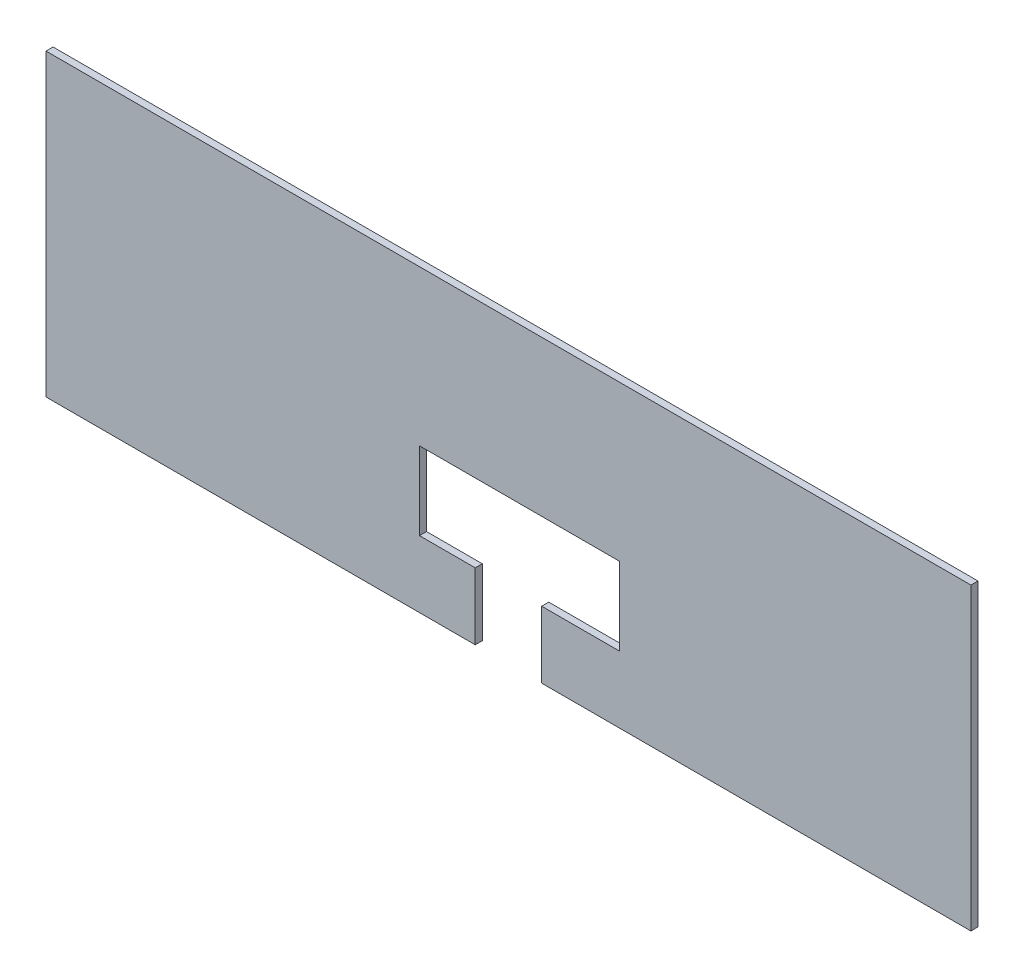
ISO-10303-21;
HEADER;
FILE_DESCRIPTION(('STEP AP214'),'2;1');
FILE_NAME('part.step','',(''),(''),'','','');
FILE_SCHEMA(('AUTOMOTIVE_DESIGN { 1 0 10303 214 1 1 1 1 }'));
ENDSEC;
DATA;
#1=APPLICATION_CONTEXT('core data for automotive mechanical design processes');
#2=APPLICATION_PROTOCOL_DEFINITION('international standard','automotive_design',2000,#1);
#3=PRODUCT_CONTEXT('',#1,'mechanical');
#4=PRODUCT('Part','Part','',(#3));
#5=PRODUCT_RELATED_PRODUCT_CATEGORY('part','',(#4));
#6=PRODUCT_DEFINITION_FORMATION('','',#4);
#7=PRODUCT_DEFINITION_CONTEXT('part definition',#1,'design');
#8=PRODUCT_DEFINITION('design','',#6,#7);
#9=PRODUCT_DEFINITION_SHAPE('','',#8);
#10=(LENGTH_UNIT() NAMED_UNIT(*) SI_UNIT(.MILLI.,.METRE.));
#11=(NAMED_UNIT(*) PLANE_ANGLE_UNIT() SI_UNIT($,.RADIAN.));
#12=(NAMED_UNIT(*) SI_UNIT($,.STERADIAN.) SOLID_ANGLE_UNIT());
#13=UNCERTAINTY_MEASURE_WITH_UNIT(LENGTH_MEASURE(1.E-05),#10,'distance_accuracy_value','');
#14=(GEOMETRIC_REPRESENTATION_CONTEXT(3) GLOBAL_UNCERTAINTY_ASSIGNED_CONTEXT((#13)) GLOBAL_UNIT_ASSIGNED_CONTEXT((#10,
#11,#12)) REPRESENTATION_CONTEXT('',''));
#15=CARTESIAN_POINT('',(0.,0.,0.));
#16=DIRECTION('',(0.,0.,1.));
#17=DIRECTION('',(1.,0.,0.));
#18=AXIS2_PLACEMENT_3D('',#15,#16,#17);
#19=CARTESIAN_POINT('',(-368.44287750437,111.148523923538,3.175));
#20=DIRECTION('',(1.,0.,0.));
#21=DIRECTION('',(0.,0.,-1.));
#22=AXIS2_PLACEMENT_3D('',#19,#20,#21);
#23=PLANE('',#22);
#24=DIRECTION('',(0.,-1.,0.));
#25=VECTOR('',#24,1.);
#26=CARTESIAN_POINT('',(-368.44287750437,111.148523923538,0.));
#27=LINE('',#26,#25);
#28=CARTESIAN_POINT('',(-368.44287750437,111.148523923538,0.));
#29=VERTEX_POINT('',#28);
#30=CARTESIAN_POINT('',(-368.44287750437,-23.6264760764616,0.));
#31=VERTEX_POINT('',#30);
#32=EDGE_CURVE('E159',#29,#31,#27,.T.);
#33=ORIENTED_EDGE('',*,*,#32,.T.);
#34=DIRECTION('',(0.,0.,-1.));
#35=VECTOR('',#34,1.);
#36=CARTESIAN_POINT('',(-368.44287750437,-23.6264760764616,3.175));
#37=LINE('',#36,#35);
#38=CARTESIAN_POINT('',(-368.44287750437,-23.6264760764616,3.175));
#39=VERTEX_POINT('',#38);
#40=EDGE_CURVE('E11',#39,#31,#37,.T.);
#41=ORIENTED_EDGE('',*,*,#40,.F.);
#42=DIRECTION('',(0.,-1.,0.));
#43=VECTOR('',#42,1.);
#44=CARTESIAN_POINT('',(-368.44287750437,111.148523923538,3.175));
#45=LINE('',#44,#43);
#46=CARTESIAN_POINT('',(-368.44287750437,111.148523923538,3.175));
#47=VERTEX_POINT('',#46);
#48=EDGE_CURVE('E181',#47,#39,#45,.T.);
#49=ORIENTED_EDGE('',*,*,#48,.F.);
#50=DIRECTION('',(0.,0.,-1.));
#51=VECTOR('',#50,1.);
#52=CARTESIAN_POINT('',(-368.44287750437,111.148523923538,3.175));
#53=LINE('',#52,#51);
#54=EDGE_CURVE('E155',#47,#29,#53,.T.);
#55=ORIENTED_EDGE('',*,*,#54,.T.);
#56=EDGE_LOOP('',(#33,#41,#49,#55));
#57=FACE_BOUND('',#56,.T.);
#58=ADVANCED_FACE('F39',(#57),#23,.F.);
#59=CARTESIAN_POINT('',(-368.44287750437,-23.6264760764616,3.175));
#60=DIRECTION('',(0.,1.,0.));
#61=DIRECTION('',(0.,0.,1.));
#62=AXIS2_PLACEMENT_3D('',#59,#60,#61);
#63=PLANE('',#62);
#64=DIRECTION('',(1.,0.,0.));
#65=VECTOR('',#64,1.);
#66=CARTESIAN_POINT('',(-368.44287750437,-23.6264760764616,0.));
#67=LINE('',#66,#65);
#68=CARTESIAN_POINT('',(-175.35287750437,-23.6264760764616,0.));
#69=VERTEX_POINT('',#68);
#70=EDGE_CURVE('E162',#31,#69,#67,.T.);
#71=ORIENTED_EDGE('',*,*,#70,.T.);
#72=DIRECTION('',(0.,0.,-1.));
#73=VECTOR('',#72,1.);
#74=CARTESIAN_POINT('',(-175.35287750437,-23.6264760764616,3.175));
#75=LINE('',#74,#73);
#76=CARTESIAN_POINT('',(-175.35287750437,-23.6264760764616,3.175));
#77=VERTEX_POINT('',#76);
#78=EDGE_CURVE('E47',#77,#69,#75,.T.);
#79=ORIENTED_EDGE('',*,*,#78,.F.);
#80=DIRECTION('',(1.,0.,0.));
#81=VECTOR('',#80,1.);
#82=CARTESIAN_POINT('',(-368.44287750437,-23.6264760764616,3.175));
#83=LINE('',#82,#81);
#84=EDGE_CURVE('E110',#39,#77,#83,.T.);
#85=ORIENTED_EDGE('',*,*,#84,.F.);
#86=ORIENTED_EDGE('',*,*,#40,.T.);
#87=EDGE_LOOP('',(#71,#79,#85,#86));
#88=FACE_BOUND('',#87,.T.);
#89=ADVANCED_FACE('F259',(#88),#63,.F.);
#90=CARTESIAN_POINT('',(-175.35287750437,6.37352392353839,3.175));
#91=DIRECTION('',(-1.,0.,0.));
#92=DIRECTION('',(0.,0.,1.));
#93=AXIS2_PLACEMENT_3D('',#90,#91,#92);
#94=PLANE('',#93);
#95=DIRECTION('',(0.,1.,0.));
#96=VECTOR('',#95,1.);
#97=CARTESIAN_POINT('',(-175.35287750437,6.37352392353839,0.));
#98=LINE('',#97,#96);
#99=CARTESIAN_POINT('',(-175.35287750437,6.37352392353839,0.));
#100=VERTEX_POINT('',#99);
#101=EDGE_CURVE('E164',#69,#100,#98,.T.);
#102=ORIENTED_EDGE('',*,*,#101,.T.);
#103=DIRECTION('',(0.,0.,-1.));
#104=VECTOR('',#103,1.);
#105=CARTESIAN_POINT('',(-175.35287750437,6.37352392353839,3.175));
#106=LINE('',#105,#104);
#107=CARTESIAN_POINT('',(-175.35287750437,6.37352392353839,3.175));
#108=VERTEX_POINT('',#107);
#109=EDGE_CURVE('E200',#108,#100,#106,.T.);
#110=ORIENTED_EDGE('',*,*,#109,.F.);
#111=DIRECTION('',(0.,1.,0.));
#112=VECTOR('',#111,1.);
#113=CARTESIAN_POINT('',(-175.35287750437,6.37352392353839,3.175));
#114=LINE('',#113,#112);
#115=EDGE_CURVE('E208',#77,#108,#114,.T.);
#116=ORIENTED_EDGE('',*,*,#115,.F.);
#117=ORIENTED_EDGE('',*,*,#78,.T.);
#118=EDGE_LOOP('',(#102,#110,#116,#117));
#119=FACE_BOUND('',#118,.T.);
#120=ADVANCED_FACE('F206',(#119),#94,.F.);
#121=CARTESIAN_POINT('',(-175.35287750437,6.37352392353839,3.175));
#122=DIRECTION('',(0.,-1.,0.));
#123=DIRECTION('',(1.,0.,0.));
#124=AXIS2_PLACEMENT_3D('',#121,#122,#123);
#125=PLANE('',#124);
#126=DIRECTION('',(-1.,0.,0.));
#127=VECTOR('',#126,1.);
#128=CARTESIAN_POINT('',(-175.35287750437,6.37352392353839,0.));
#129=LINE('',#128,#127);
#130=CARTESIAN_POINT('',(-200.43364614192,6.37352392353836,0.));
#131=VERTEX_POINT('',#130);
#132=EDGE_CURVE('E166',#100,#131,#129,.T.);
#133=ORIENTED_EDGE('',*,*,#132,.T.);
#134=DIRECTION('',(0.,0.,-1.));
#135=VECTOR('',#134,1.);
#136=CARTESIAN_POINT('',(-200.43364614192,6.37352392353836,3.175));
#137=LINE('',#136,#135);
#138=CARTESIAN_POINT('',(-200.43364614192,6.37352392353836,3.175));
#139=VERTEX_POINT('',#138);
#140=EDGE_CURVE('E197',#139,#131,#137,.T.);
#141=ORIENTED_EDGE('',*,*,#140,.F.);
#142=DIRECTION('',(-1.,0.,0.));
#143=VECTOR('',#142,1.);
#144=CARTESIAN_POINT('',(-175.35287750437,6.37352392353839,3.175));
#145=LINE('',#144,#143);
#146=EDGE_CURVE('E226',#108,#139,#145,.T.);
#147=ORIENTED_EDGE('',*,*,#146,.F.);
#148=ORIENTED_EDGE('',*,*,#109,.T.);
#149=EDGE_LOOP('',(#133,#141,#147,#148));
#150=FACE_BOUND('',#149,.T.);
#151=ADVANCED_FACE('F217',(#150),#125,.F.);
#152=CARTESIAN_POINT('',(-200.43364614192,6.37352392353836,3.175));
#153=DIRECTION('',(-1.,0.,0.));
#154=DIRECTION('',(0.,0.,1.));
#155=AXIS2_PLACEMENT_3D('',#152,#153,#154);
#156=PLANE('',#155);
#157=DIRECTION('',(0.,1.,0.));
#158=VECTOR('',#157,1.);
#159=CARTESIAN_POINT('',(-200.43364614192,6.37352392353836,0.));
#160=LINE('',#159,#158);
#161=CARTESIAN_POINT('',(-200.43364614192,41.3735239235383,0.));
#162=VERTEX_POINT('',#161);
#163=EDGE_CURVE('E168',#131,#162,#160,.T.);
#164=ORIENTED_EDGE('',*,*,#163,.T.);
#165=DIRECTION('',(0.,0.,-1.));
#166=VECTOR('',#165,1.);
#167=CARTESIAN_POINT('',(-200.43364614192,41.3735239235383,3.175));
#168=LINE('',#167,#166);
#169=CARTESIAN_POINT('',(-200.43364614192,41.3735239235383,3.175));
#170=VERTEX_POINT('',#169);
#171=EDGE_CURVE('E194',#170,#162,#168,.T.);
#172=ORIENTED_EDGE('',*,*,#171,.F.);
#173=DIRECTION('',(0.,1.,0.));
#174=VECTOR('',#173,1.);
#175=CARTESIAN_POINT('',(-200.43364614192,6.37352392353836,3.175));
#176=LINE('',#175,#174);
#177=EDGE_CURVE('E223',#139,#170,#176,.T.);
#178=ORIENTED_EDGE('',*,*,#177,.F.);
#179=ORIENTED_EDGE('',*,*,#140,.T.);
#180=EDGE_LOOP('',(#164,#172,#178,#179));
#181=FACE_BOUND('',#180,.T.);
#182=ADVANCED_FACE('F221',(#181),#156,.F.);
#183=CARTESIAN_POINT('',(-110.45287750437,41.3735239235383,3.175));
#184=DIRECTION('',(0.,1.,0.));
#185=DIRECTION('',(0.,0.,1.));
#186=AXIS2_PLACEMENT_3D('',#183,#184,#185);
#187=PLANE('',#186);
#188=DIRECTION('',(1.,0.,0.));
#189=VECTOR('',#188,1.);
#190=CARTESIAN_POINT('',(-110.45287750437,41.3735239235383,0.));
#191=LINE('',#190,#189);
#192=CARTESIAN_POINT('',(-110.45287750437,41.3735239235383,0.));
#193=VERTEX_POINT('',#192);
#194=EDGE_CURVE('E170',#162,#193,#191,.T.);
#195=ORIENTED_EDGE('',*,*,#194,.T.);
#196=DIRECTION('',(0.,0.,-1.));
#197=VECTOR('',#196,1.);
#198=CARTESIAN_POINT('',(-110.45287750437,41.3735239235383,3.175));
#199=LINE('',#198,#197);
#200=CARTESIAN_POINT('',(-110.45287750437,41.3735239235383,3.175));
#201=VERTEX_POINT('',#200);
#202=EDGE_CURVE('E191',#201,#193,#199,.T.);
#203=ORIENTED_EDGE('',*,*,#202,.F.);
#204=DIRECTION('',(1.,0.,0.));
#205=VECTOR('',#204,1.);
#206=CARTESIAN_POINT('',(-110.45287750437,41.3735239235383,3.175));
#207=LINE('',#206,#205);
#208=EDGE_CURVE('E225',#170,#201,#207,.T.);
#209=ORIENTED_EDGE('',*,*,#208,.F.);
#210=ORIENTED_EDGE('',*,*,#171,.T.);
#211=EDGE_LOOP('',(#195,#203,#209,#210));
#212=FACE_BOUND('',#211,.T.);
#213=ADVANCED_FACE('F272',(#212),#187,.F.);
#214=CARTESIAN_POINT('',(-110.45287750437,6.3735239235383,3.175));
#215=DIRECTION('',(1.,0.,0.));
#216=DIRECTION('',(0.,0.,-1.));
#217=AXIS2_PLACEMENT_3D('',#214,#215,#216);
#218=PLANE('',#217);
#219=DIRECTION('',(0.,-1.,0.));
#220=VECTOR('',#219,1.);
#221=CARTESIAN_POINT('',(-110.45287750437,6.3735239235383,0.));
#222=LINE('',#221,#220);
#223=CARTESIAN_POINT('',(-110.45287750437,6.3735239235383,0.));
#224=VERTEX_POINT('',#223);
#225=EDGE_CURVE('E172',#193,#224,#222,.T.);
#226=ORIENTED_EDGE('',*,*,#225,.T.);
#227=DIRECTION('',(0.,0.,-1.));
#228=VECTOR('',#227,1.);
#229=CARTESIAN_POINT('',(-110.45287750437,6.3735239235383,3.175));
#230=LINE('',#229,#228);
#231=CARTESIAN_POINT('',(-110.45287750437,6.3735239235383,3.175));
#232=VERTEX_POINT('',#231);
#233=EDGE_CURVE('E188',#232,#224,#230,.T.);
#234=ORIENTED_EDGE('',*,*,#233,.F.);
#235=DIRECTION('',(0.,-1.,0.));
#236=VECTOR('',#235,1.);
#237=CARTESIAN_POINT('',(-110.45287750437,6.3735239235383,3.175));
#238=LINE('',#237,#236);
#239=EDGE_CURVE('E228',#201,#232,#238,.T.);
#240=ORIENTED_EDGE('',*,*,#239,.F.);
#241=ORIENTED_EDGE('',*,*,#202,.T.);
#242=EDGE_LOOP('',(#226,#234,#240,#241));
#243=FACE_BOUND('',#242,.T.);
#244=ADVANCED_FACE('F275',(#243),#218,.F.);
#245=CARTESIAN_POINT('',(-145.45287750437,6.3735239235383,3.175));
#246=DIRECTION('',(0.,-1.,0.));
#247=DIRECTION('',(0.,0.,-1.));
#248=AXIS2_PLACEMENT_3D('',#245,#246,#247);
#249=PLANE('',#248);
#250=DIRECTION('',(-1.,0.,0.));
#251=VECTOR('',#250,1.);
#252=CARTESIAN_POINT('',(-145.45287750437,6.3735239235383,0.));
#253=LINE('',#252,#251);
#254=CARTESIAN_POINT('',(-145.45287750437,6.3735239235383,0.));
#255=VERTEX_POINT('',#254);
#256=EDGE_CURVE('E174',#224,#255,#253,.T.);
#257=ORIENTED_EDGE('',*,*,#256,.T.);
#258=DIRECTION('',(0.,0.,-1.));
#259=VECTOR('',#258,1.);
#260=CARTESIAN_POINT('',(-145.45287750437,6.3735239235383,3.175));
#261=LINE('',#260,#259);
#262=CARTESIAN_POINT('',(-145.45287750437,6.3735239235383,3.175));
#263=VERTEX_POINT('',#262);
#264=EDGE_CURVE('E185',#263,#255,#261,.T.);
#265=ORIENTED_EDGE('',*,*,#264,.F.);
#266=DIRECTION('',(-1.,0.,0.));
#267=VECTOR('',#266,1.);
#268=CARTESIAN_POINT('',(-145.45287750437,6.3735239235383,3.175));
#269=LINE('',#268,#267);
#270=EDGE_CURVE('E234',#232,#263,#269,.T.);
#271=ORIENTED_EDGE('',*,*,#270,.F.);
#272=ORIENTED_EDGE('',*,*,#233,.T.);
#273=EDGE_LOOP('',(#257,#265,#271,#272));
#274=FACE_BOUND('',#273,.T.);
#275=ADVANCED_FACE('F240',(#274),#249,.F.);
#276=CARTESIAN_POINT('',(-145.45287750437,6.3735239235383,3.175));
#277=DIRECTION('',(1.,0.,0.));
#278=DIRECTION('',(0.,0.,-1.));
#279=AXIS2_PLACEMENT_3D('',#276,#277,#278);
#280=PLANE('',#279);
#281=DIRECTION('',(0.,-1.,0.));
#282=VECTOR('',#281,1.);
#283=CARTESIAN_POINT('',(-145.45287750437,6.3735239235383,0.));
#284=LINE('',#283,#282);
#285=CARTESIAN_POINT('',(-145.45287750437,-23.6264760764616,0.));
#286=VERTEX_POINT('',#285);
#287=EDGE_CURVE('E176',#255,#286,#284,.T.);
#288=ORIENTED_EDGE('',*,*,#287,.T.);
#289=DIRECTION('',(0.,0.,-1.));
#290=VECTOR('',#289,1.);
#291=CARTESIAN_POINT('',(-145.45287750437,-23.6264760764616,3.175));
#292=LINE('',#291,#290);
#293=CARTESIAN_POINT('',(-145.45287750437,-23.6264760764616,3.175));
#294=VERTEX_POINT('',#293);
#295=EDGE_CURVE('E150',#294,#286,#292,.T.);
#296=ORIENTED_EDGE('',*,*,#295,.F.);
#297=DIRECTION('',(0.,-1.,0.));
#298=VECTOR('',#297,1.);
#299=CARTESIAN_POINT('',(-145.45287750437,6.3735239235383,3.175));
#300=LINE('',#299,#298);
#301=EDGE_CURVE('E141',#263,#294,#300,.T.);
#302=ORIENTED_EDGE('',*,*,#301,.F.);
#303=ORIENTED_EDGE('',*,*,#264,.T.);
#304=EDGE_LOOP('',(#288,#296,#302,#303));
#305=FACE_BOUND('',#304,.T.);
#306=ADVANCED_FACE('F244',(#305),#280,.F.);
#307=CARTESIAN_POINT('',(-145.45287750437,-23.6264760764616,3.175));
#308=DIRECTION('',(0.,1.,0.));
#309=DIRECTION('',(0.,0.,1.));
#310=AXIS2_PLACEMENT_3D('',#307,#308,#309);
#311=PLANE('',#310);
#312=DIRECTION('',(1.,0.,0.));
#313=VECTOR('',#312,1.);
#314=CARTESIAN_POINT('',(-145.45287750437,-23.6264760764616,0.));
#315=LINE('',#314,#313);
#316=CARTESIAN_POINT('',(47.63712249563,-23.6264760764616,0.));
#317=VERTEX_POINT('',#316);
#318=EDGE_CURVE('E149',#286,#317,#315,.T.);
#319=ORIENTED_EDGE('',*,*,#318,.T.);
#320=DIRECTION('',(0.,0.,-1.));
#321=VECTOR('',#320,1.);
#322=CARTESIAN_POINT('',(47.63712249563,-23.6264760764616,3.175));
#323=LINE('',#322,#321);
#324=CARTESIAN_POINT('',(47.63712249563,-23.6264760764616,3.175));
#325=VERTEX_POINT('',#324);
#326=EDGE_CURVE('E146',#325,#317,#323,.T.);
#327=ORIENTED_EDGE('',*,*,#326,.F.);
#328=DIRECTION('',(1.,0.,0.));
#329=VECTOR('',#328,1.);
#330=CARTESIAN_POINT('',(-145.45287750437,-23.6264760764616,3.175));
#331=LINE('',#330,#329);
#332=EDGE_CURVE('E135',#294,#325,#331,.T.);
#333=ORIENTED_EDGE('',*,*,#332,.F.);
#334=ORIENTED_EDGE('',*,*,#295,.T.);
#335=EDGE_LOOP('',(#319,#327,#333,#334));
#336=FACE_BOUND('',#335,.T.);
#337=ADVANCED_FACE('F147',(#336),#311,.F.);
#338=CARTESIAN_POINT('',(47.63712249563,111.148523923538,3.175));
#339=DIRECTION('',(-1.,0.,0.));
#340=DIRECTION('',(0.,0.,1.));
#341=AXIS2_PLACEMENT_3D('',#338,#339,#340);
#342=PLANE('',#341);
#343=DIRECTION('',(0.,1.,0.));
#344=VECTOR('',#343,1.);
#345=CARTESIAN_POINT('',(47.63712249563,111.148523923538,0.));
#346=LINE('',#345,#344);
#347=CARTESIAN_POINT('',(47.63712249563,111.148523923538,0.));
#348=VERTEX_POINT('',#347);
#349=EDGE_CURVE('E96',#317,#348,#346,.T.);
#350=ORIENTED_EDGE('',*,*,#349,.T.);
#351=DIRECTION('',(0.,0.,-1.));
#352=VECTOR('',#351,1.);
#353=CARTESIAN_POINT('',(47.63712249563,111.148523923538,3.175));
#354=LINE('',#353,#352);
#355=CARTESIAN_POINT('',(47.63712249563,111.148523923538,3.175));
#356=VERTEX_POINT('',#355);
#357=EDGE_CURVE('E151',#356,#348,#354,.T.);
#358=ORIENTED_EDGE('',*,*,#357,.F.);
#359=DIRECTION('',(0.,1.,0.));
#360=VECTOR('',#359,1.);
#361=CARTESIAN_POINT('',(47.63712249563,111.148523923538,3.175));
#362=LINE('',#361,#360);
#363=EDGE_CURVE('E139',#325,#356,#362,.T.);
#364=ORIENTED_EDGE('',*,*,#363,.F.);
#365=ORIENTED_EDGE('',*,*,#326,.T.);
#366=EDGE_LOOP('',(#350,#358,#364,#365));
#367=FACE_BOUND('',#366,.T.);
#368=ADVANCED_FACE('F153',(#367),#342,.F.);
#369=CARTESIAN_POINT('',(-368.44287750437,111.148523923538,3.175));
#370=DIRECTION('',(0.,-1.,0.));
#371=DIRECTION('',(1.,0.,0.));
#372=AXIS2_PLACEMENT_3D('',#369,#370,#371);
#373=PLANE('',#372);
#374=DIRECTION('',(-1.,0.,0.));
#375=VECTOR('',#374,1.);
#376=CARTESIAN_POINT('',(-368.44287750437,111.148523923538,0.));
#377=LINE('',#376,#375);
#378=EDGE_CURVE('E102',#348,#29,#377,.T.);
#379=ORIENTED_EDGE('',*,*,#378,.T.);
#380=ORIENTED_EDGE('',*,*,#54,.F.);
#381=DIRECTION('',(-1.,0.,0.));
#382=VECTOR('',#381,1.);
#383=CARTESIAN_POINT('',(-368.44287750437,111.148523923538,3.175));
#384=LINE('',#383,#382);
#385=EDGE_CURVE('E55',#356,#47,#384,.T.);
#386=ORIENTED_EDGE('',*,*,#385,.F.);
#387=ORIENTED_EDGE('',*,*,#357,.T.);
#388=EDGE_LOOP('',(#379,#380,#386,#387));
#389=FACE_BOUND('',#388,.T.);
#390=ADVANCED_FACE('F248',(#389),#373,.F.);
#391=CARTESIAN_POINT('',(0.,0.,3.175));
#392=DIRECTION('',(0.,0.,1.));
#393=DIRECTION('',(1.,0.,0.));
#394=AXIS2_PLACEMENT_3D('',#391,#392,#393);
#395=PLANE('',#394);
#396=ORIENTED_EDGE('',*,*,#48,.T.);
#397=ORIENTED_EDGE('',*,*,#84,.T.);
#398=ORIENTED_EDGE('',*,*,#115,.T.);
#399=ORIENTED_EDGE('',*,*,#146,.T.);
#400=ORIENTED_EDGE('',*,*,#177,.T.);
#401=ORIENTED_EDGE('',*,*,#208,.T.);
#402=ORIENTED_EDGE('',*,*,#239,.T.);
#403=ORIENTED_EDGE('',*,*,#270,.T.);
#404=ORIENTED_EDGE('',*,*,#301,.T.);
#405=ORIENTED_EDGE('',*,*,#332,.T.);
#406=ORIENTED_EDGE('',*,*,#363,.T.);
#407=ORIENTED_EDGE('',*,*,#385,.T.);
#408=EDGE_LOOP('',(#396,#397,#398,#399,#400,#401,#402,#403,#404,#405,#406,#407));
#409=FACE_BOUND('',#408,.T.);
#410=ADVANCED_FACE('F137',(#409),#395,.T.);
#411=CARTESIAN_POINT('',(0.,0.,0.));
#412=DIRECTION('',(0.,0.,1.));
#413=DIRECTION('',(1.,0.,0.));
#414=AXIS2_PLACEMENT_3D('',#411,#412,#413);
#415=PLANE('',#414);
#416=ORIENTED_EDGE('',*,*,#32,.F.);
#417=ORIENTED_EDGE('',*,*,#378,.F.);
#418=ORIENTED_EDGE('',*,*,#349,.F.);
#419=ORIENTED_EDGE('',*,*,#318,.F.);
#420=ORIENTED_EDGE('',*,*,#287,.F.);
#421=ORIENTED_EDGE('',*,*,#256,.F.);
#422=ORIENTED_EDGE('',*,*,#225,.F.);
#423=ORIENTED_EDGE('',*,*,#194,.F.);
#424=ORIENTED_EDGE('',*,*,#163,.F.);
#425=ORIENTED_EDGE('',*,*,#132,.F.);
#426=ORIENTED_EDGE('',*,*,#101,.F.);
#427=ORIENTED_EDGE('',*,*,#70,.F.);
#428=EDGE_LOOP('',(#416,#417,#418,#419,#420,#421,#422,#423,#424,#425,#426,#427));
#429=FACE_BOUND('',#428,.T.);
#430=ADVANCED_FACE('F212',(#429),#415,.F.);
#431=CLOSED_SHELL('',(#58,#89,#120,#151,#182,#213,#244,#275,#306,#337,#368,#390,#410,#430));
#432=MANIFOLD_SOLID_BREP('B2',#431);
#433=ADVANCED_BREP_SHAPE_REPRESENTATION('',(#18,#432),#14);
#434=SHAPE_DEFINITION_REPRESENTATION(#9,#433);
ENDSEC;
END-ISO-10303-21;
